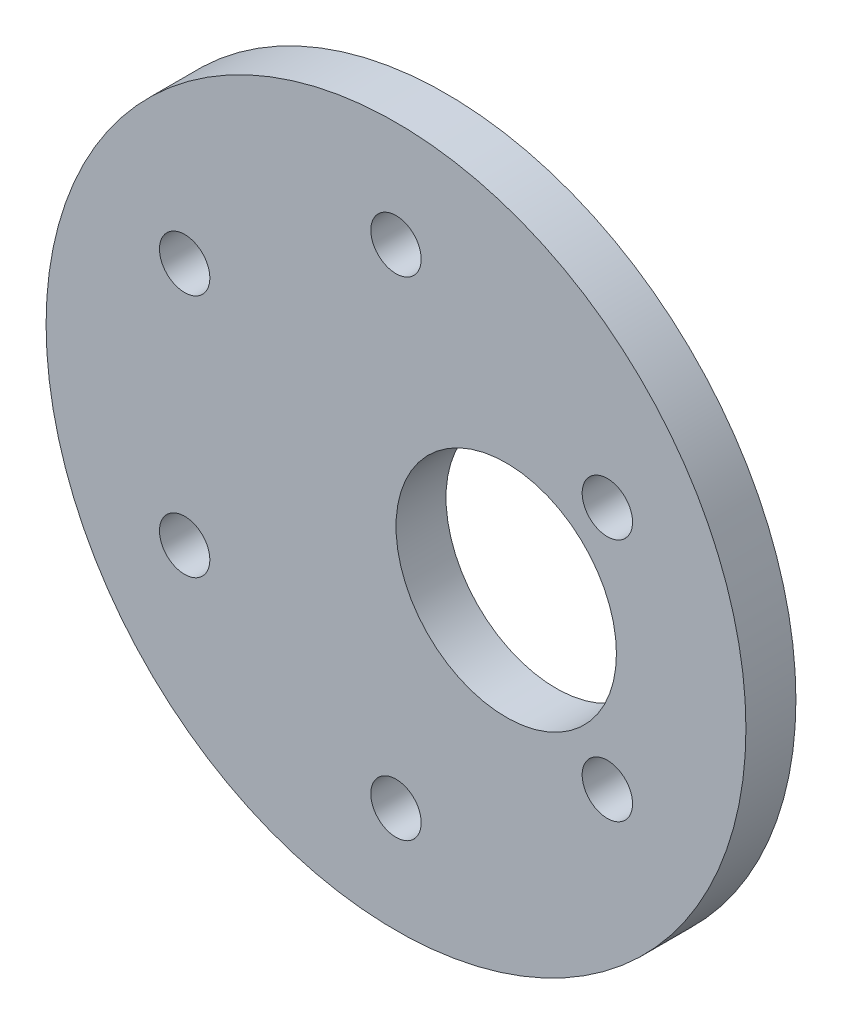
ISO-10303-21;
HEADER;
FILE_DESCRIPTION(('STEP AP214'),'2;1');
FILE_NAME('part.step','',(''),(''),'','','');
FILE_SCHEMA(('AUTOMOTIVE_DESIGN { 1 0 10303 214 1 1 1 1 }'));
ENDSEC;
DATA;
#1=APPLICATION_CONTEXT('core data for automotive mechanical design processes');
#2=APPLICATION_PROTOCOL_DEFINITION('international standard','automotive_design',2000,#1);
#3=PRODUCT_CONTEXT('',#1,'mechanical');
#4=PRODUCT('Part','Part','',(#3));
#5=PRODUCT_RELATED_PRODUCT_CATEGORY('part','',(#4));
#6=PRODUCT_DEFINITION_FORMATION('','',#4);
#7=PRODUCT_DEFINITION_CONTEXT('part definition',#1,'design');
#8=PRODUCT_DEFINITION('design','',#6,#7);
#9=PRODUCT_DEFINITION_SHAPE('','',#8);
#10=(LENGTH_UNIT() NAMED_UNIT(*) SI_UNIT(.MILLI.,.METRE.));
#11=(NAMED_UNIT(*) PLANE_ANGLE_UNIT() SI_UNIT($,.RADIAN.));
#12=(NAMED_UNIT(*) SI_UNIT($,.STERADIAN.) SOLID_ANGLE_UNIT());
#13=UNCERTAINTY_MEASURE_WITH_UNIT(LENGTH_MEASURE(1.E-05),#10,'distance_accuracy_value','');
#14=(GEOMETRIC_REPRESENTATION_CONTEXT(3) GLOBAL_UNCERTAINTY_ASSIGNED_CONTEXT((#13)) GLOBAL_UNIT_ASSIGNED_CONTEXT((#10,
#11,#12)) REPRESENTATION_CONTEXT('',''));
#15=CARTESIAN_POINT('',(0.,0.,0.));
#16=DIRECTION('',(0.,0.,1.));
#17=DIRECTION('',(1.,0.,0.));
#18=AXIS2_PLACEMENT_3D('',#15,#16,#17);
#19=CARTESIAN_POINT('',(0.,0.,3.175));
#20=DIRECTION('',(0.,0.,-1.));
#21=DIRECTION('',(-1.,0.,0.));
#22=AXIS2_PLACEMENT_3D('',#19,#20,#21);
#23=CYLINDRICAL_SURFACE('',#22,22.225);
#24=CARTESIAN_POINT('',(0.,0.,3.175));
#25=DIRECTION('',(0.,0.,1.));
#26=DIRECTION('',(1.,0.,0.));
#27=AXIS2_PLACEMENT_3D('',#24,#25,#26);
#28=CIRCLE('',#27,22.225);
#29=CARTESIAN_POINT('',(22.225,0.,3.175));
#30=VERTEX_POINT('',#29);
#31=EDGE_CURVE('E10',#30,#30,#28,.T.);
#32=ORIENTED_EDGE('',*,*,#31,.F.);
#33=EDGE_LOOP('',(#32));
#34=FACE_BOUND('',#33,.T.);
#35=CARTESIAN_POINT('',(0.,0.,0.));
#36=DIRECTION('',(0.,0.,1.));
#37=DIRECTION('',(1.,0.,0.));
#38=AXIS2_PLACEMENT_3D('',#35,#36,#37);
#39=CIRCLE('',#38,22.225);
#40=CARTESIAN_POINT('',(22.225,0.,0.));
#41=VERTEX_POINT('',#40);
#42=EDGE_CURVE('E32',#41,#41,#39,.T.);
#43=ORIENTED_EDGE('',*,*,#42,.T.);
#44=EDGE_LOOP('',(#43));
#45=FACE_BOUND('',#44,.T.);
#46=ADVANCED_FACE('F29',(#34,#45),#23,.T.);
#47=CARTESIAN_POINT('',(0.,0.,3.175));
#48=DIRECTION('',(0.,0.,1.));
#49=DIRECTION('',(1.,0.,0.));
#50=AXIS2_PLACEMENT_3D('',#47,#48,#49);
#51=PLANE('',#50);
#52=CARTESIAN_POINT('',(7.,0.,3.175));
#53=DIRECTION('',(0.,0.,1.));
#54=DIRECTION('',(1.,0.,0.));
#55=AXIS2_PLACEMENT_3D('',#52,#53,#54);
#56=CIRCLE('',#55,7.);
#57=CARTESIAN_POINT('',(14.,0.,3.175));
#58=VERTEX_POINT('',#57);
#59=EDGE_CURVE('E79',#58,#58,#56,.T.);
#60=ORIENTED_EDGE('',*,*,#59,.F.);
#61=EDGE_LOOP('',(#60));
#62=FACE_BOUND('',#61,.T.);
#63=CARTESIAN_POINT('',(-13.4233937586588,7.75,3.175));
#64=DIRECTION('',(0.,0.,1.));
#65=DIRECTION('',(1.,0.,0.));
#66=AXIS2_PLACEMENT_3D('',#63,#64,#65);
#67=CIRCLE('',#66,1.59999999999999);
#68=CARTESIAN_POINT('',(-11.8233937586588,7.75,3.175));
#69=VERTEX_POINT('',#68);
#70=EDGE_CURVE('E73',#69,#69,#67,.T.);
#71=ORIENTED_EDGE('',*,*,#70,.F.);
#72=EDGE_LOOP('',(#71));
#73=FACE_BOUND('',#72,.T.);
#74=CARTESIAN_POINT('',(0.,15.5,3.175));
#75=DIRECTION('',(0.,0.,1.));
#76=DIRECTION('',(1.,0.,0.));
#77=AXIS2_PLACEMENT_3D('',#74,#75,#76);
#78=CIRCLE('',#77,1.59999999999999);
#79=CARTESIAN_POINT('',(1.59999999999999,15.5,3.175));
#80=VERTEX_POINT('',#79);
#81=EDGE_CURVE('E67',#80,#80,#78,.T.);
#82=ORIENTED_EDGE('',*,*,#81,.F.);
#83=EDGE_LOOP('',(#82));
#84=FACE_BOUND('',#83,.T.);
#85=CARTESIAN_POINT('',(13.4233937586588,7.75,3.175));
#86=DIRECTION('',(0.,0.,1.));
#87=DIRECTION('',(1.,0.,0.));
#88=AXIS2_PLACEMENT_3D('',#85,#86,#87);
#89=CIRCLE('',#88,1.59999999999999);
#90=CARTESIAN_POINT('',(15.0233937586588,7.75,3.175));
#91=VERTEX_POINT('',#90);
#92=EDGE_CURVE('E61',#91,#91,#89,.T.);
#93=ORIENTED_EDGE('',*,*,#92,.F.);
#94=EDGE_LOOP('',(#93));
#95=FACE_BOUND('',#94,.T.);
#96=CARTESIAN_POINT('',(13.4233937586588,-7.75,3.175));
#97=DIRECTION('',(0.,0.,1.));
#98=DIRECTION('',(1.,0.,0.));
#99=AXIS2_PLACEMENT_3D('',#96,#97,#98);
#100=CIRCLE('',#99,1.59999999999999);
#101=CARTESIAN_POINT('',(15.0233937586588,-7.75,3.175));
#102=VERTEX_POINT('',#101);
#103=EDGE_CURVE('E55',#102,#102,#100,.T.);
#104=ORIENTED_EDGE('',*,*,#103,.F.);
#105=EDGE_LOOP('',(#104));
#106=FACE_BOUND('',#105,.T.);
#107=CARTESIAN_POINT('',(0.,-15.5,3.175));
#108=DIRECTION('',(0.,0.,1.));
#109=DIRECTION('',(1.,0.,0.));
#110=AXIS2_PLACEMENT_3D('',#107,#108,#109);
#111=CIRCLE('',#110,1.59999999999999);
#112=CARTESIAN_POINT('',(1.59999999999999,-15.5,3.175));
#113=VERTEX_POINT('',#112);
#114=EDGE_CURVE('E49',#113,#113,#111,.T.);
#115=ORIENTED_EDGE('',*,*,#114,.F.);
#116=EDGE_LOOP('',(#115));
#117=FACE_BOUND('',#116,.T.);
#118=CARTESIAN_POINT('',(-13.4233937586588,-7.75,3.175));
#119=DIRECTION('',(0.,0.,1.));
#120=DIRECTION('',(1.,0.,0.));
#121=AXIS2_PLACEMENT_3D('',#118,#119,#120);
#122=CIRCLE('',#121,1.59999999999999);
#123=CARTESIAN_POINT('',(-11.8233937586588,-7.75,3.175));
#124=VERTEX_POINT('',#123);
#125=EDGE_CURVE('E43',#124,#124,#122,.T.);
#126=ORIENTED_EDGE('',*,*,#125,.F.);
#127=EDGE_LOOP('',(#126));
#128=FACE_BOUND('',#127,.T.);
#129=ORIENTED_EDGE('',*,*,#31,.T.);
#130=EDGE_LOOP('',(#129));
#131=FACE_BOUND('',#130,.T.);
#132=ADVANCED_FACE('F86',(#62,#73,#84,#95,#106,#117,#128,#131),#51,.T.);
#133=CARTESIAN_POINT('',(0.,0.,0.));
#134=DIRECTION('',(0.,0.,1.));
#135=DIRECTION('',(1.,0.,0.));
#136=AXIS2_PLACEMENT_3D('',#133,#134,#135);
#137=PLANE('',#136);
#138=CARTESIAN_POINT('',(7.,0.,0.));
#139=DIRECTION('',(0.,0.,1.));
#140=DIRECTION('',(1.,0.,0.));
#141=AXIS2_PLACEMENT_3D('',#138,#139,#140);
#142=CIRCLE('',#141,7.);
#143=CARTESIAN_POINT('',(14.,0.,0.));
#144=VERTEX_POINT('',#143);
#145=EDGE_CURVE('E76',#144,#144,#142,.F.);
#146=ORIENTED_EDGE('',*,*,#145,.F.);
#147=EDGE_LOOP('',(#146));
#148=FACE_BOUND('',#147,.T.);
#149=CARTESIAN_POINT('',(-13.4233937586588,7.75,0.));
#150=DIRECTION('',(0.,0.,1.));
#151=DIRECTION('',(1.,0.,0.));
#152=AXIS2_PLACEMENT_3D('',#149,#150,#151);
#153=CIRCLE('',#152,1.59999999999999);
#154=CARTESIAN_POINT('',(-11.8233937586588,7.75,0.));
#155=VERTEX_POINT('',#154);
#156=EDGE_CURVE('E70',#155,#155,#153,.T.);
#157=ORIENTED_EDGE('',*,*,#156,.T.);
#158=EDGE_LOOP('',(#157));
#159=FACE_BOUND('',#158,.T.);
#160=CARTESIAN_POINT('',(0.,15.5,0.));
#161=DIRECTION('',(0.,0.,1.));
#162=DIRECTION('',(1.,0.,0.));
#163=AXIS2_PLACEMENT_3D('',#160,#161,#162);
#164=CIRCLE('',#163,1.59999999999999);
#165=CARTESIAN_POINT('',(1.6,15.5,0.));
#166=VERTEX_POINT('',#165);
#167=EDGE_CURVE('E64',#166,#166,#164,.T.);
#168=ORIENTED_EDGE('',*,*,#167,.T.);
#169=EDGE_LOOP('',(#168));
#170=FACE_BOUND('',#169,.T.);
#171=CARTESIAN_POINT('',(13.4233937586588,7.75,0.));
#172=DIRECTION('',(0.,0.,1.));
#173=DIRECTION('',(1.,0.,0.));
#174=AXIS2_PLACEMENT_3D('',#171,#172,#173);
#175=CIRCLE('',#174,1.59999999999999);
#176=CARTESIAN_POINT('',(15.0233937586588,7.75,0.));
#177=VERTEX_POINT('',#176);
#178=EDGE_CURVE('E58',#177,#177,#175,.T.);
#179=ORIENTED_EDGE('',*,*,#178,.T.);
#180=EDGE_LOOP('',(#179));
#181=FACE_BOUND('',#180,.T.);
#182=CARTESIAN_POINT('',(13.4233937586588,-7.75,0.));
#183=DIRECTION('',(0.,0.,1.));
#184=DIRECTION('',(1.,0.,0.));
#185=AXIS2_PLACEMENT_3D('',#182,#183,#184);
#186=CIRCLE('',#185,1.59999999999999);
#187=CARTESIAN_POINT('',(15.0233937586588,-7.75,0.));
#188=VERTEX_POINT('',#187);
#189=EDGE_CURVE('E52',#188,#188,#186,.T.);
#190=ORIENTED_EDGE('',*,*,#189,.T.);
#191=EDGE_LOOP('',(#190));
#192=FACE_BOUND('',#191,.T.);
#193=CARTESIAN_POINT('',(0.,-15.5,0.));
#194=DIRECTION('',(0.,0.,1.));
#195=DIRECTION('',(1.,0.,0.));
#196=AXIS2_PLACEMENT_3D('',#193,#194,#195);
#197=CIRCLE('',#196,1.59999999999999);
#198=CARTESIAN_POINT('',(1.59999999999999,-15.5,0.));
#199=VERTEX_POINT('',#198);
#200=EDGE_CURVE('E46',#199,#199,#197,.T.);
#201=ORIENTED_EDGE('',*,*,#200,.T.);
#202=EDGE_LOOP('',(#201));
#203=FACE_BOUND('',#202,.T.);
#204=CARTESIAN_POINT('',(-13.4233937586588,-7.75,0.));
#205=DIRECTION('',(0.,0.,1.));
#206=DIRECTION('',(1.,0.,0.));
#207=AXIS2_PLACEMENT_3D('',#204,#205,#206);
#208=CIRCLE('',#207,1.59999999999999);
#209=CARTESIAN_POINT('',(-11.8233937586588,-7.75,0.));
#210=VERTEX_POINT('',#209);
#211=EDGE_CURVE('E39',#210,#210,#208,.T.);
#212=ORIENTED_EDGE('',*,*,#211,.T.);
#213=EDGE_LOOP('',(#212));
#214=FACE_BOUND('',#213,.T.);
#215=ORIENTED_EDGE('',*,*,#42,.F.);
#216=EDGE_LOOP('',(#215));
#217=FACE_BOUND('',#216,.T.);
#218=ADVANCED_FACE('F89',(#148,#159,#170,#181,#192,#203,#214,#217),#137,.F.);
#219=CARTESIAN_POINT('',(-13.4233937586588,-7.75,3.175));
#220=DIRECTION('',(0.,0.,1.));
#221=DIRECTION('',(1.,0.,0.));
#222=AXIS2_PLACEMENT_3D('',#219,#220,#221);
#223=CYLINDRICAL_SURFACE('',#222,1.59999999999999);
#224=ORIENTED_EDGE('',*,*,#211,.F.);
#225=EDGE_LOOP('',(#224));
#226=FACE_BOUND('',#225,.T.);
#227=ORIENTED_EDGE('',*,*,#125,.T.);
#228=EDGE_LOOP('',(#227));
#229=FACE_BOUND('',#228,.T.);
#230=ADVANCED_FACE('F103',(#226,#229),#223,.F.);
#231=CARTESIAN_POINT('',(0.,-15.5,3.175));
#232=DIRECTION('',(0.,0.,1.));
#233=DIRECTION('',(1.,0.,0.));
#234=AXIS2_PLACEMENT_3D('',#231,#232,#233);
#235=CYLINDRICAL_SURFACE('',#234,1.59999999999999);
#236=ORIENTED_EDGE('',*,*,#200,.F.);
#237=EDGE_LOOP('',(#236));
#238=FACE_BOUND('',#237,.T.);
#239=ORIENTED_EDGE('',*,*,#114,.T.);
#240=EDGE_LOOP('',(#239));
#241=FACE_BOUND('',#240,.T.);
#242=ADVANCED_FACE('F105',(#238,#241),#235,.F.);
#243=CARTESIAN_POINT('',(13.4233937586588,-7.75,3.175));
#244=DIRECTION('',(0.,0.,1.));
#245=DIRECTION('',(1.,0.,0.));
#246=AXIS2_PLACEMENT_3D('',#243,#244,#245);
#247=CYLINDRICAL_SURFACE('',#246,1.59999999999999);
#248=ORIENTED_EDGE('',*,*,#189,.F.);
#249=EDGE_LOOP('',(#248));
#250=FACE_BOUND('',#249,.T.);
#251=ORIENTED_EDGE('',*,*,#103,.T.);
#252=EDGE_LOOP('',(#251));
#253=FACE_BOUND('',#252,.T.);
#254=ADVANCED_FACE('F112',(#250,#253),#247,.F.);
#255=CARTESIAN_POINT('',(13.4233937586588,7.75,3.175));
#256=DIRECTION('',(0.,0.,1.));
#257=DIRECTION('',(1.,0.,0.));
#258=AXIS2_PLACEMENT_3D('',#255,#256,#257);
#259=CYLINDRICAL_SURFACE('',#258,1.59999999999999);
#260=ORIENTED_EDGE('',*,*,#178,.F.);
#261=EDGE_LOOP('',(#260));
#262=FACE_BOUND('',#261,.T.);
#263=ORIENTED_EDGE('',*,*,#92,.T.);
#264=EDGE_LOOP('',(#263));
#265=FACE_BOUND('',#264,.T.);
#266=ADVANCED_FACE('F158',(#262,#265),#259,.F.);
#267=CARTESIAN_POINT('',(0.,15.5,3.175));
#268=DIRECTION('',(0.,0.,1.));
#269=DIRECTION('',(1.,0.,0.));
#270=AXIS2_PLACEMENT_3D('',#267,#268,#269);
#271=CYLINDRICAL_SURFACE('',#270,1.59999999999999);
#272=ORIENTED_EDGE('',*,*,#167,.F.);
#273=EDGE_LOOP('',(#272));
#274=FACE_BOUND('',#273,.T.);
#275=ORIENTED_EDGE('',*,*,#81,.T.);
#276=EDGE_LOOP('',(#275));
#277=FACE_BOUND('',#276,.T.);
#278=ADVANCED_FACE('F151',(#274,#277),#271,.F.);
#279=CARTESIAN_POINT('',(-13.4233937586588,7.75,3.175));
#280=DIRECTION('',(0.,0.,1.));
#281=DIRECTION('',(1.,0.,0.));
#282=AXIS2_PLACEMENT_3D('',#279,#280,#281);
#283=CYLINDRICAL_SURFACE('',#282,1.59999999999999);
#284=ORIENTED_EDGE('',*,*,#156,.F.);
#285=EDGE_LOOP('',(#284));
#286=FACE_BOUND('',#285,.T.);
#287=ORIENTED_EDGE('',*,*,#70,.T.);
#288=EDGE_LOOP('',(#287));
#289=FACE_BOUND('',#288,.T.);
#290=ADVANCED_FACE('F142',(#286,#289),#283,.F.);
#291=CARTESIAN_POINT('',(7.,0.,-0.00100000000000013));
#292=DIRECTION('',(0.,0.,1.));
#293=DIRECTION('',(1.,0.,0.));
#294=AXIS2_PLACEMENT_3D('',#291,#292,#293);
#295=CYLINDRICAL_SURFACE('',#294,7.);
#296=ORIENTED_EDGE('',*,*,#59,.T.);
#297=EDGE_LOOP('',(#296));
#298=FACE_BOUND('',#297,.T.);
#299=ORIENTED_EDGE('',*,*,#145,.T.);
#300=EDGE_LOOP('',(#299));
#301=FACE_BOUND('',#300,.T.);
#302=ADVANCED_FACE('F83',(#298,#301),#295,.F.);
#303=CLOSED_SHELL('',(#46,#132,#218,#230,#242,#254,#266,#278,#290,#302));
#304=MANIFOLD_SOLID_BREP('B2',#303);
#305=ADVANCED_BREP_SHAPE_REPRESENTATION('',(#18,#304),#14);
#306=SHAPE_DEFINITION_REPRESENTATION(#9,#305);
ENDSEC;
END-ISO-10303-21;
